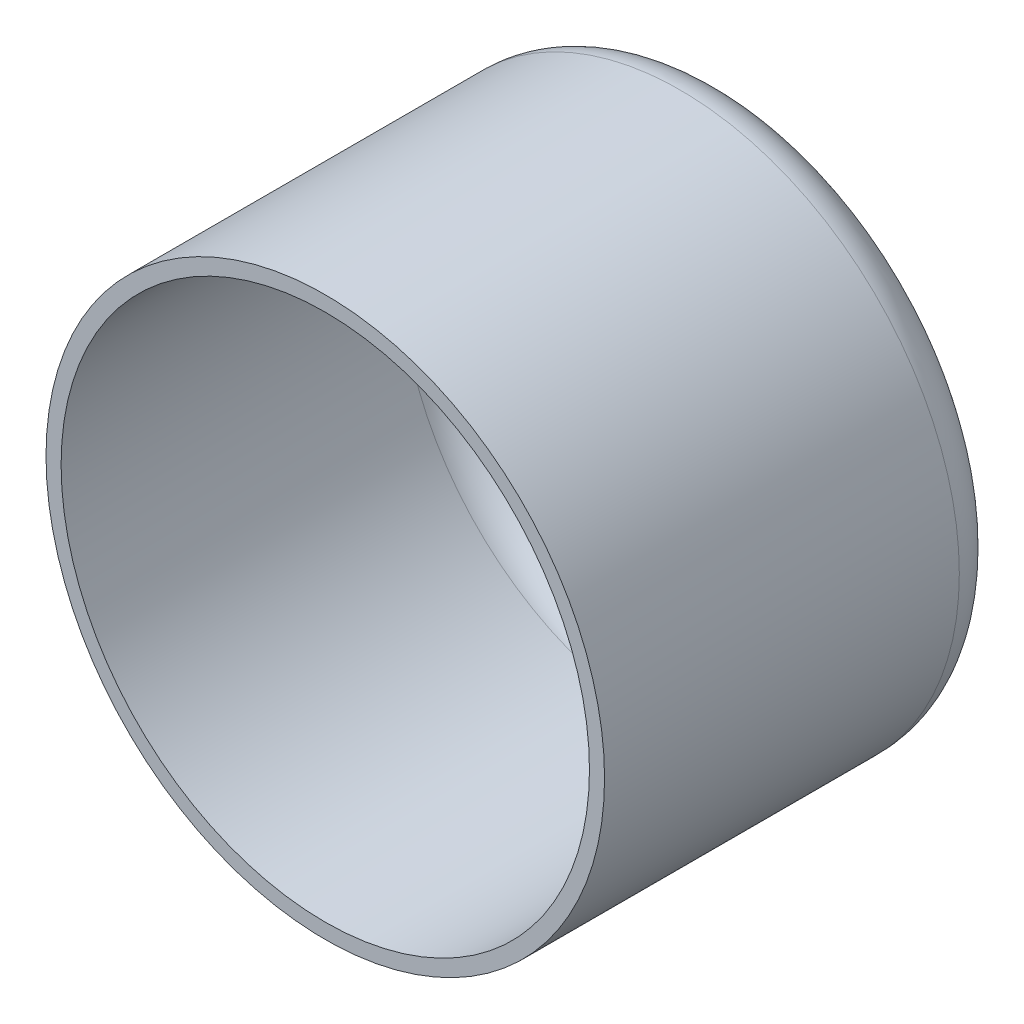
ISO-10303-21;
HEADER;
FILE_DESCRIPTION(('STEP AP214'),'2;1');
FILE_NAME('part.step','',(''),(''),'','','');
FILE_SCHEMA(('AUTOMOTIVE_DESIGN { 1 0 10303 214 1 1 1 1 }'));
ENDSEC;
DATA;
#1=APPLICATION_CONTEXT('core data for automotive mechanical design processes');
#2=APPLICATION_PROTOCOL_DEFINITION('international standard','automotive_design',2000,#1);
#3=PRODUCT_CONTEXT('',#1,'mechanical');
#4=PRODUCT('Part','Part','',(#3));
#5=PRODUCT_RELATED_PRODUCT_CATEGORY('part','',(#4));
#6=PRODUCT_DEFINITION_FORMATION('','',#4);
#7=PRODUCT_DEFINITION_CONTEXT('part definition',#1,'design');
#8=PRODUCT_DEFINITION('design','',#6,#7);
#9=PRODUCT_DEFINITION_SHAPE('','',#8);
#10=(LENGTH_UNIT() NAMED_UNIT(*) SI_UNIT(.MILLI.,.METRE.));
#11=(NAMED_UNIT(*) PLANE_ANGLE_UNIT() SI_UNIT($,.RADIAN.));
#12=(NAMED_UNIT(*) SI_UNIT($,.STERADIAN.) SOLID_ANGLE_UNIT());
#13=UNCERTAINTY_MEASURE_WITH_UNIT(LENGTH_MEASURE(1.E-05),#10,'distance_accuracy_value','');
#14=(GEOMETRIC_REPRESENTATION_CONTEXT(3) GLOBAL_UNCERTAINTY_ASSIGNED_CONTEXT((#13)) GLOBAL_UNIT_ASSIGNED_CONTEXT((#10,
#11,#12)) REPRESENTATION_CONTEXT('',''));
#15=CARTESIAN_POINT('',(0.,0.,0.));
#16=DIRECTION('',(0.,0.,1.));
#17=DIRECTION('',(1.,0.,0.));
#18=AXIS2_PLACEMENT_3D('',#15,#16,#17);
#19=CARTESIAN_POINT('',(0.,0.,1.));
#20=DIRECTION('',(0.,0.,1.));
#21=DIRECTION('',(1.,0.,0.));
#22=AXIS2_PLACEMENT_3D('',#19,#20,#21);
#23=PLANE('',#22);
#24=CARTESIAN_POINT('',(0.,0.,1.));
#25=DIRECTION('',(0.,0.,1.));
#26=DIRECTION('',(1.,0.,0.));
#27=AXIS2_PLACEMENT_3D('',#24,#25,#26);
#28=CIRCLE('',#27,14.5);
#29=CARTESIAN_POINT('',(14.5,0.,1.));
#30=VERTEX_POINT('',#29);
#31=EDGE_CURVE('E10',#30,#30,#28,.T.);
#32=ORIENTED_EDGE('',*,*,#31,.T.);
#33=EDGE_LOOP('',(#32));
#34=FACE_BOUND('',#33,.T.);
#35=CARTESIAN_POINT('',(0.338070114672478,-7.19205871761107,1.));
#36=DIRECTION('',(0.,0.,1.));
#37=DIRECTION('',(1.,0.,0.));
#38=AXIS2_PLACEMENT_3D('',#35,#36,#37);
#39=CIRCLE('',#38,6.);
#40=CARTESIAN_POINT('',(6.33807011467248,-7.19205871761107,1.));
#41=VERTEX_POINT('',#40);
#42=EDGE_CURVE('E51',#41,#41,#39,.T.);
#43=ORIENTED_EDGE('',*,*,#42,.F.);
#44=EDGE_LOOP('',(#43));
#45=FACE_BOUND('',#44,.T.);
#46=ADVANCED_FACE('F31',(#34,#45),#23,.T.);
#47=CARTESIAN_POINT('',(0.,0.,0.));
#48=DIRECTION('',(0.,0.,1.));
#49=DIRECTION('',(1.,0.,0.));
#50=AXIS2_PLACEMENT_3D('',#47,#48,#49);
#51=PLANE('',#50);
#52=CARTESIAN_POINT('',(0.,0.,0.));
#53=DIRECTION('',(0.,0.,1.));
#54=DIRECTION('',(1.,0.,0.));
#55=AXIS2_PLACEMENT_3D('',#52,#53,#54);
#56=CIRCLE('',#55,15.5);
#57=CARTESIAN_POINT('',(15.5,0.,0.));
#58=VERTEX_POINT('',#57);
#59=EDGE_CURVE('E42',#58,#58,#56,.F.);
#60=ORIENTED_EDGE('',*,*,#59,.T.);
#61=EDGE_LOOP('',(#60));
#62=FACE_BOUND('',#61,.T.);
#63=CARTESIAN_POINT('',(0.338070114672478,-7.19205871761107,0.));
#64=DIRECTION('',(0.,0.,1.));
#65=DIRECTION('',(1.,0.,0.));
#66=AXIS2_PLACEMENT_3D('',#63,#64,#65);
#67=CIRCLE('',#66,6.);
#68=CARTESIAN_POINT('',(6.33807011467248,-7.19205871761107,0.));
#69=VERTEX_POINT('',#68);
#70=EDGE_CURVE('E52',#69,#69,#67,.T.);
#71=ORIENTED_EDGE('',*,*,#70,.T.);
#72=EDGE_LOOP('',(#71));
#73=FACE_BOUND('',#72,.T.);
#74=ADVANCED_FACE('F81',(#62,#73),#51,.F.);
#75=CARTESIAN_POINT('',(0.,0.,1.));
#76=DIRECTION('',(0.,0.,-1.));
#77=DIRECTION('',(-1.,0.,0.));
#78=AXIS2_PLACEMENT_3D('',#75,#76,#77);
#79=CYLINDRICAL_SURFACE('',#78,18.5);
#80=CARTESIAN_POINT('',(0.,0.,3.));
#81=DIRECTION('',(0.,0.,1.));
#82=DIRECTION('',(1.,0.,0.));
#83=AXIS2_PLACEMENT_3D('',#80,#81,#82);
#84=CIRCLE('',#83,18.5);
#85=CARTESIAN_POINT('',(18.5,0.,3.));
#86=VERTEX_POINT('',#85);
#87=EDGE_CURVE('E46',#86,#86,#84,.T.);
#88=ORIENTED_EDGE('',*,*,#87,.T.);
#89=EDGE_LOOP('',(#88));
#90=FACE_BOUND('',#89,.T.);
#91=CARTESIAN_POINT('',(0.,0.,26.5));
#92=DIRECTION('',(0.,0.,1.));
#93=DIRECTION('',(1.,0.,0.));
#94=AXIS2_PLACEMENT_3D('',#91,#92,#93);
#95=CIRCLE('',#94,18.5);
#96=CARTESIAN_POINT('',(18.5,0.,26.5));
#97=VERTEX_POINT('',#96);
#98=EDGE_CURVE('E55',#97,#97,#95,.T.);
#99=ORIENTED_EDGE('',*,*,#98,.F.);
#100=EDGE_LOOP('',(#99));
#101=FACE_BOUND('',#100,.T.);
#102=ADVANCED_FACE('F77',(#90,#101),#79,.T.);
#103=CARTESIAN_POINT('',(0.338070114672478,-7.19205871761107,1.));
#104=DIRECTION('',(0.,0.,-1.));
#105=DIRECTION('',(-1.,0.,0.));
#106=AXIS2_PLACEMENT_3D('',#103,#104,#105);
#107=CYLINDRICAL_SURFACE('',#106,6.);
#108=ORIENTED_EDGE('',*,*,#42,.T.);
#109=EDGE_LOOP('',(#108));
#110=FACE_BOUND('',#109,.T.);
#111=ORIENTED_EDGE('',*,*,#70,.F.);
#112=EDGE_LOOP('',(#111));
#113=FACE_BOUND('',#112,.T.);
#114=ADVANCED_FACE('F68',(#110,#113),#107,.F.);
#115=CARTESIAN_POINT('',(0.,0.,26.5));
#116=DIRECTION('',(0.,0.,1.));
#117=DIRECTION('',(1.,0.,0.));
#118=AXIS2_PLACEMENT_3D('',#115,#116,#117);
#119=PLANE('',#118);
#120=ORIENTED_EDGE('',*,*,#98,.T.);
#121=EDGE_LOOP('',(#120));
#122=FACE_BOUND('',#121,.T.);
#123=CARTESIAN_POINT('',(0.,0.,26.5));
#124=DIRECTION('',(0.,0.,1.));
#125=DIRECTION('',(1.,0.,0.));
#126=AXIS2_PLACEMENT_3D('',#123,#124,#125);
#127=CIRCLE('',#126,17.5);
#128=CARTESIAN_POINT('',(17.5,0.,26.5));
#129=VERTEX_POINT('',#128);
#130=EDGE_CURVE('E60',#129,#129,#127,.T.);
#131=ORIENTED_EDGE('',*,*,#130,.F.);
#132=EDGE_LOOP('',(#131));
#133=FACE_BOUND('',#132,.T.);
#134=ADVANCED_FACE('F66',(#122,#133),#119,.T.);
#135=CARTESIAN_POINT('',(0.,0.,26.5));
#136=DIRECTION('',(0.,0.,-1.));
#137=DIRECTION('',(-1.,0.,0.));
#138=AXIS2_PLACEMENT_3D('',#135,#136,#137);
#139=CYLINDRICAL_SURFACE('',#138,17.5);
#140=CARTESIAN_POINT('',(0.,0.,4.));
#141=DIRECTION('',(0.,0.,1.));
#142=DIRECTION('',(1.,0.,0.));
#143=AXIS2_PLACEMENT_3D('',#140,#141,#142);
#144=CIRCLE('',#143,17.5);
#145=CARTESIAN_POINT('',(17.5,0.,4.));
#146=VERTEX_POINT('',#145);
#147=EDGE_CURVE('E38',#146,#146,#144,.F.);
#148=ORIENTED_EDGE('',*,*,#147,.T.);
#149=EDGE_LOOP('',(#148));
#150=FACE_BOUND('',#149,.T.);
#151=ORIENTED_EDGE('',*,*,#130,.T.);
#152=EDGE_LOOP('',(#151));
#153=FACE_BOUND('',#152,.T.);
#154=ADVANCED_FACE('F64',(#150,#153),#139,.F.);
#155=CARTESIAN_POINT('',(0.,0.,3.));
#156=DIRECTION('',(0.,0.,1.));
#157=DIRECTION('',(1.,0.,0.));
#158=AXIS2_PLACEMENT_3D('',#155,#156,#157);
#159=TOROIDAL_SURFACE('',#158,15.5,3.);
#160=ORIENTED_EDGE('',*,*,#59,.F.);
#161=EDGE_LOOP('',(#160));
#162=FACE_BOUND('',#161,.T.);
#163=ORIENTED_EDGE('',*,*,#87,.F.);
#164=EDGE_LOOP('',(#163));
#165=FACE_BOUND('',#164,.T.);
#166=ADVANCED_FACE('F75',(#162,#165),#159,.T.);
#167=CARTESIAN_POINT('',(0.,0.,4.));
#168=DIRECTION('',(0.,0.,1.));
#169=DIRECTION('',(1.,0.,0.));
#170=AXIS2_PLACEMENT_3D('',#167,#168,#169);
#171=TOROIDAL_SURFACE('',#170,14.5,3.);
#172=ORIENTED_EDGE('',*,*,#31,.F.);
#173=EDGE_LOOP('',(#172));
#174=FACE_BOUND('',#173,.T.);
#175=ORIENTED_EDGE('',*,*,#147,.F.);
#176=EDGE_LOOP('',(#175));
#177=FACE_BOUND('',#176,.T.);
#178=ADVANCED_FACE('F33',(#174,#177),#171,.F.);
#179=CLOSED_SHELL('',(#46,#74,#102,#114,#134,#154,#166,#178));
#180=MANIFOLD_SOLID_BREP('B2',#179);
#181=ADVANCED_BREP_SHAPE_REPRESENTATION('',(#18,#180),#14);
#182=SHAPE_DEFINITION_REPRESENTATION(#9,#181);
ENDSEC;
END-ISO-10303-21;
